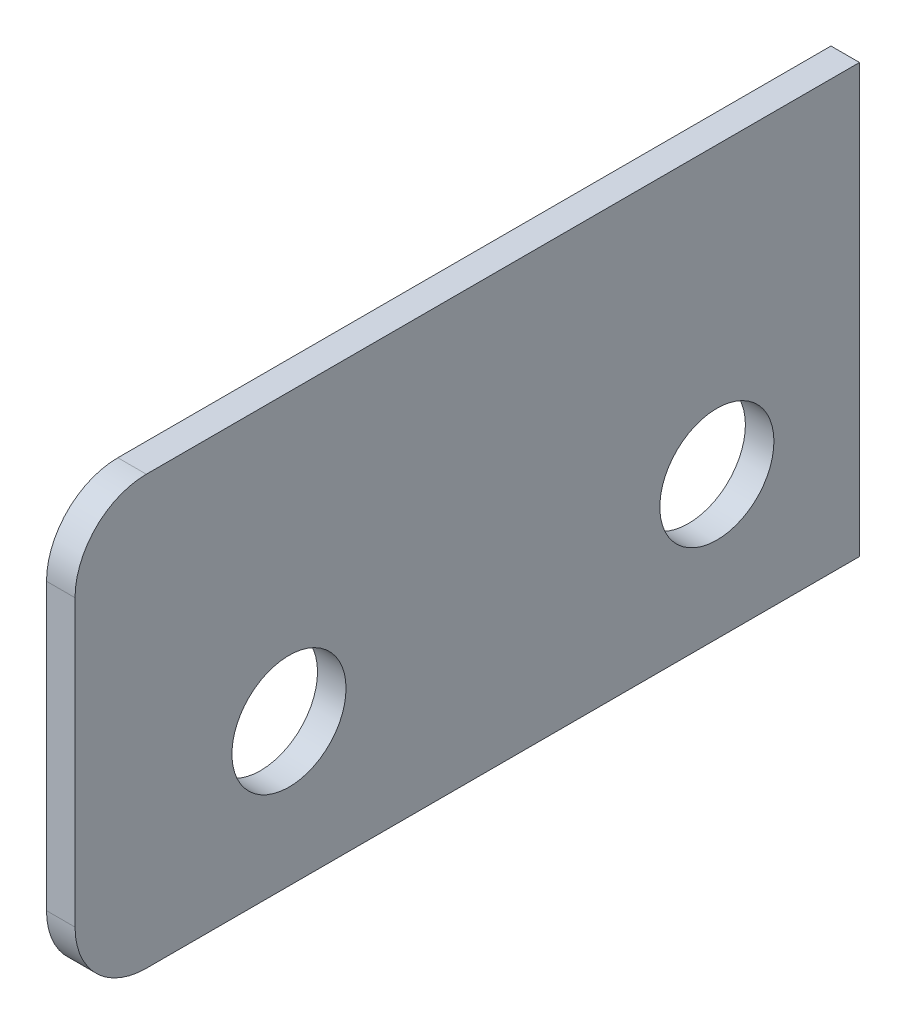
ISO-10303-21;
HEADER;
FILE_DESCRIPTION(('STEP AP214'),'2;1');
FILE_NAME('part.step','',(''),(''),'','','');
FILE_SCHEMA(('AUTOMOTIVE_DESIGN { 1 0 10303 214 1 1 1 1 }'));
ENDSEC;
DATA;
#1=APPLICATION_CONTEXT('core data for automotive mechanical design processes');
#2=APPLICATION_PROTOCOL_DEFINITION('international standard','automotive_design',2000,#1);
#3=PRODUCT_CONTEXT('',#1,'mechanical');
#4=PRODUCT('Part','Part','',(#3));
#5=PRODUCT_RELATED_PRODUCT_CATEGORY('part','',(#4));
#6=PRODUCT_DEFINITION_FORMATION('','',#4);
#7=PRODUCT_DEFINITION_CONTEXT('part definition',#1,'design');
#8=PRODUCT_DEFINITION('design','',#6,#7);
#9=PRODUCT_DEFINITION_SHAPE('','',#8);
#10=(LENGTH_UNIT() NAMED_UNIT(*) SI_UNIT(.MILLI.,.METRE.));
#11=(NAMED_UNIT(*) PLANE_ANGLE_UNIT() SI_UNIT($,.RADIAN.));
#12=(NAMED_UNIT(*) SI_UNIT($,.STERADIAN.) SOLID_ANGLE_UNIT());
#13=UNCERTAINTY_MEASURE_WITH_UNIT(LENGTH_MEASURE(1.E-05),#10,'distance_accuracy_value','');
#14=(GEOMETRIC_REPRESENTATION_CONTEXT(3) GLOBAL_UNCERTAINTY_ASSIGNED_CONTEXT((#13)) GLOBAL_UNIT_ASSIGNED_CONTEXT((#10,
#11,#12)) REPRESENTATION_CONTEXT('',''));
#15=CARTESIAN_POINT('',(0.,0.,0.));
#16=DIRECTION('',(0.,0.,1.));
#17=DIRECTION('',(1.,0.,0.));
#18=AXIS2_PLACEMENT_3D('',#15,#16,#17);
#19=CARTESIAN_POINT('',(1339.,-70.,1.99999999999999));
#20=DIRECTION('',(0.,1.,0.));
#21=DIRECTION('',(0.,0.,-1.));
#22=AXIS2_PLACEMENT_3D('',#19,#20,#21);
#23=PLANE('',#22);
#24=DIRECTION('',(0.,0.,1.));
#25=VECTOR('',#24,1.);
#26=CARTESIAN_POINT('',(1337.,-70.,1.99999999999999));
#27=LINE('',#26,#25);
#28=CARTESIAN_POINT('',(1337.,-70.,6.99999999999998));
#29=VERTEX_POINT('',#28);
#30=CARTESIAN_POINT('',(1337.,-70.,57.0000000000001));
#31=VERTEX_POINT('',#30);
#32=EDGE_CURVE('E101',#29,#31,#27,.T.);
#33=ORIENTED_EDGE('',*,*,#32,.F.);
#34=DIRECTION('',(1.,0.,0.));
#35=VECTOR('',#34,1.);
#36=CARTESIAN_POINT('',(1194.91074273878,-70.,6.99999999999998));
#37=LINE('',#36,#35);
#38=CARTESIAN_POINT('',(1339.,-70.,6.99999999999998));
#39=VERTEX_POINT('',#38);
#40=EDGE_CURVE('E50',#29,#39,#37,.T.);
#41=ORIENTED_EDGE('',*,*,#40,.T.);
#42=DIRECTION('',(0.,0.,1.));
#43=VECTOR('',#42,1.);
#44=CARTESIAN_POINT('',(1339.,-70.,1.99999999999999));
#45=LINE('',#44,#43);
#46=CARTESIAN_POINT('',(1339.,-70.,57.0000000000001));
#47=VERTEX_POINT('',#46);
#48=EDGE_CURVE('E99',#39,#47,#45,.T.);
#49=ORIENTED_EDGE('',*,*,#48,.T.);
#50=DIRECTION('',(-1.,0.,0.));
#51=VECTOR('',#50,1.);
#52=CARTESIAN_POINT('',(1339.,-70.,57.0000000000001));
#53=LINE('',#52,#51);
#54=EDGE_CURVE('E135',#31,#47,#53,.F.);
#55=ORIENTED_EDGE('',*,*,#54,.F.);
#56=EDGE_LOOP('',(#33,#41,#49,#55));
#57=FACE_BOUND('',#56,.T.);
#58=ADVANCED_FACE('F36',(#57),#23,.F.);
#59=CARTESIAN_POINT('',(1339.,-70.,62.0000000000001));
#60=DIRECTION('',(0.,0.,-1.));
#61=DIRECTION('',(-1.,0.,0.));
#62=AXIS2_PLACEMENT_3D('',#59,#60,#61);
#63=PLANE('',#62);
#64=DIRECTION('',(0.,1.,0.));
#65=VECTOR('',#64,1.);
#66=CARTESIAN_POINT('',(1339.,-70.,62.0000000000001));
#67=LINE('',#66,#65);
#68=CARTESIAN_POINT('',(1339.,-65.,62.0000000000001));
#69=VERTEX_POINT('',#68);
#70=CARTESIAN_POINT('',(1339.,-45.,62.0000000000001));
#71=VERTEX_POINT('',#70);
#72=EDGE_CURVE('E107',#69,#71,#67,.T.);
#73=ORIENTED_EDGE('',*,*,#72,.T.);
#74=DIRECTION('',(-1.,0.,0.));
#75=VECTOR('',#74,1.);
#76=CARTESIAN_POINT('',(1339.,-45.,62.0000000000001));
#77=LINE('',#76,#75);
#78=CARTESIAN_POINT('',(1337.,-45.,62.0000000000001));
#79=VERTEX_POINT('',#78);
#80=EDGE_CURVE('E121',#79,#71,#77,.F.);
#81=ORIENTED_EDGE('',*,*,#80,.F.);
#82=DIRECTION('',(0.,1.,0.));
#83=VECTOR('',#82,1.);
#84=CARTESIAN_POINT('',(1337.,-70.,62.0000000000001));
#85=LINE('',#84,#83);
#86=CARTESIAN_POINT('',(1337.,-65.,62.0000000000001));
#87=VERTEX_POINT('',#86);
#88=EDGE_CURVE('E114',#87,#79,#85,.T.);
#89=ORIENTED_EDGE('',*,*,#88,.F.);
#90=DIRECTION('',(-1.,0.,0.));
#91=VECTOR('',#90,1.);
#92=CARTESIAN_POINT('',(1339.,-65.,62.0000000000001));
#93=LINE('',#92,#91);
#94=EDGE_CURVE('E127',#69,#87,#93,.T.);
#95=ORIENTED_EDGE('',*,*,#94,.F.);
#96=EDGE_LOOP('',(#73,#81,#89,#95));
#97=FACE_BOUND('',#96,.T.);
#98=ADVANCED_FACE('F167',(#97),#63,.F.);
#99=CARTESIAN_POINT('',(1339.,-40.,2.));
#100=DIRECTION('',(0.,-1.,0.));
#101=DIRECTION('',(0.,0.,1.));
#102=AXIS2_PLACEMENT_3D('',#99,#100,#101);
#103=PLANE('',#102);
#104=DIRECTION('',(0.,0.,-1.));
#105=VECTOR('',#104,1.);
#106=CARTESIAN_POINT('',(1339.,-40.,2.));
#107=LINE('',#106,#105);
#108=CARTESIAN_POINT('',(1339.,-40.,57.0000000000001));
#109=VERTEX_POINT('',#108);
#110=CARTESIAN_POINT('',(1339.,-40.,6.99999999999999));
#111=VERTEX_POINT('',#110);
#112=EDGE_CURVE('E111',#109,#111,#107,.T.);
#113=ORIENTED_EDGE('',*,*,#112,.T.);
#114=DIRECTION('',(-1.,0.,0.));
#115=VECTOR('',#114,1.);
#116=CARTESIAN_POINT('',(1339.,-40.,6.99999999999999));
#117=LINE('',#116,#115);
#118=CARTESIAN_POINT('',(1337.,-40.,6.99999999999999));
#119=VERTEX_POINT('',#118);
#120=EDGE_CURVE('E90',#111,#119,#117,.T.);
#121=ORIENTED_EDGE('',*,*,#120,.T.);
#122=DIRECTION('',(0.,0.,-1.));
#123=VECTOR('',#122,1.);
#124=CARTESIAN_POINT('',(1337.,-40.,1.99999999999999));
#125=LINE('',#124,#123);
#126=CARTESIAN_POINT('',(1337.,-40.,57.0000000000001));
#127=VERTEX_POINT('',#126);
#128=EDGE_CURVE('E108',#127,#119,#125,.T.);
#129=ORIENTED_EDGE('',*,*,#128,.F.);
#130=DIRECTION('',(-1.,0.,0.));
#131=VECTOR('',#130,1.);
#132=CARTESIAN_POINT('',(1339.,-40.,57.0000000000001));
#133=LINE('',#132,#131);
#134=EDGE_CURVE('E44',#109,#127,#133,.T.);
#135=ORIENTED_EDGE('',*,*,#134,.F.);
#136=EDGE_LOOP('',(#113,#121,#129,#135));
#137=FACE_BOUND('',#136,.T.);
#138=ADVANCED_FACE('F161',(#137),#103,.F.);
#139=CARTESIAN_POINT('',(1339.,0.,0.));
#140=DIRECTION('',(-1.,0.,0.));
#141=DIRECTION('',(0.,0.,1.));
#142=AXIS2_PLACEMENT_3D('',#139,#140,#141);
#143=PLANE('',#142);
#144=CARTESIAN_POINT('',(1339.,-60.,47.0000000000001));
#145=DIRECTION('',(-1.,0.,0.));
#146=DIRECTION('',(0.,0.,-1.));
#147=AXIS2_PLACEMENT_3D('',#144,#145,#146);
#148=CIRCLE('',#147,4.00000000000001);
#149=CARTESIAN_POINT('',(1339.,-60.,43.));
#150=VERTEX_POINT('',#149);
#151=EDGE_CURVE('E142',#150,#150,#148,.T.);
#152=ORIENTED_EDGE('',*,*,#151,.T.);
#153=EDGE_LOOP('',(#152));
#154=FACE_BOUND('',#153,.T.);
#155=CARTESIAN_POINT('',(1339.,-60.,17.));
#156=DIRECTION('',(-1.,0.,0.));
#157=DIRECTION('',(0.,0.,-1.));
#158=AXIS2_PLACEMENT_3D('',#155,#156,#157);
#159=CIRCLE('',#158,4.);
#160=CARTESIAN_POINT('',(1339.,-60.,13.));
#161=VERTEX_POINT('',#160);
#162=EDGE_CURVE('E117',#161,#161,#159,.T.);
#163=ORIENTED_EDGE('',*,*,#162,.T.);
#164=EDGE_LOOP('',(#163));
#165=FACE_BOUND('',#164,.T.);
#166=ORIENTED_EDGE('',*,*,#48,.F.);
#167=DIRECTION('',(0.,-1.,0.));
#168=VECTOR('',#167,1.);
#169=CARTESIAN_POINT('',(1339.,70.,7.));
#170=LINE('',#169,#168);
#171=EDGE_CURVE('E87',#111,#39,#170,.T.);
#172=ORIENTED_EDGE('',*,*,#171,.F.);
#173=ORIENTED_EDGE('',*,*,#112,.F.);
#174=CARTESIAN_POINT('',(1339.,-45.,57.0000000000001));
#175=DIRECTION('',(1.,0.,0.));
#176=DIRECTION('',(0.,0.,1.));
#177=AXIS2_PLACEMENT_3D('',#174,#175,#176);
#178=CIRCLE('',#177,5.);
#179=EDGE_CURVE('E58',#71,#109,#178,.F.);
#180=ORIENTED_EDGE('',*,*,#179,.F.);
#181=ORIENTED_EDGE('',*,*,#72,.F.);
#182=CARTESIAN_POINT('',(1339.,-65.,57.0000000000001));
#183=DIRECTION('',(1.,0.,0.));
#184=DIRECTION('',(0.,0.,1.));
#185=AXIS2_PLACEMENT_3D('',#182,#183,#184);
#186=CIRCLE('',#185,5.);
#187=EDGE_CURVE('E105',#47,#69,#186,.F.);
#188=ORIENTED_EDGE('',*,*,#187,.F.);
#189=EDGE_LOOP('',(#166,#172,#173,#180,#181,#188));
#190=FACE_BOUND('',#189,.T.);
#191=ADVANCED_FACE('F103',(#154,#165,#190),#143,.F.);
#192=CARTESIAN_POINT('',(1337.,0.,0.));
#193=DIRECTION('',(-1.,0.,0.));
#194=DIRECTION('',(0.,0.,1.));
#195=AXIS2_PLACEMENT_3D('',#192,#193,#194);
#196=PLANE('',#195);
#197=DIRECTION('',(0.,1.,0.));
#198=VECTOR('',#197,1.);
#199=CARTESIAN_POINT('',(1337.,0.,6.99999999999999));
#200=LINE('',#199,#198);
#201=EDGE_CURVE('E11',#29,#119,#200,.T.);
#202=ORIENTED_EDGE('',*,*,#201,.F.);
#203=ORIENTED_EDGE('',*,*,#32,.T.);
#204=CARTESIAN_POINT('',(1337.,-65.,57.0000000000001));
#205=DIRECTION('',(1.,0.,0.));
#206=DIRECTION('',(0.,0.,1.));
#207=AXIS2_PLACEMENT_3D('',#204,#205,#206);
#208=CIRCLE('',#207,5.);
#209=EDGE_CURVE('E132',#87,#31,#208,.T.);
#210=ORIENTED_EDGE('',*,*,#209,.F.);
#211=ORIENTED_EDGE('',*,*,#88,.T.);
#212=CARTESIAN_POINT('',(1337.,-45.,57.0000000000001));
#213=DIRECTION('',(1.,0.,0.));
#214=DIRECTION('',(0.,0.,1.));
#215=AXIS2_PLACEMENT_3D('',#212,#213,#214);
#216=CIRCLE('',#215,5.);
#217=EDGE_CURVE('E130',#127,#79,#216,.T.);
#218=ORIENTED_EDGE('',*,*,#217,.F.);
#219=ORIENTED_EDGE('',*,*,#128,.T.);
#220=EDGE_LOOP('',(#202,#203,#210,#211,#218,#219));
#221=FACE_BOUND('',#220,.T.);
#222=CARTESIAN_POINT('',(1337.,-60.,47.0000000000001));
#223=DIRECTION('',(1.,0.,0.));
#224=DIRECTION('',(0.,0.,1.));
#225=AXIS2_PLACEMENT_3D('',#222,#223,#224);
#226=CIRCLE('',#225,4.00000000000001);
#227=CARTESIAN_POINT('',(1337.,-60.,51.0000000000001));
#228=VERTEX_POINT('',#227);
#229=EDGE_CURVE('E123',#228,#228,#226,.T.);
#230=ORIENTED_EDGE('',*,*,#229,.T.);
#231=EDGE_LOOP('',(#230));
#232=FACE_BOUND('',#231,.T.);
#233=CARTESIAN_POINT('',(1337.,-60.,17.));
#234=DIRECTION('',(1.,0.,0.));
#235=DIRECTION('',(0.,0.,1.));
#236=AXIS2_PLACEMENT_3D('',#233,#234,#235);
#237=CIRCLE('',#236,4.);
#238=CARTESIAN_POINT('',(1337.,-60.,21.));
#239=VERTEX_POINT('',#238);
#240=EDGE_CURVE('E140',#239,#239,#237,.T.);
#241=ORIENTED_EDGE('',*,*,#240,.T.);
#242=EDGE_LOOP('',(#241));
#243=FACE_BOUND('',#242,.T.);
#244=ADVANCED_FACE('F146',(#221,#232,#243),#196,.T.);
#245=CARTESIAN_POINT('',(1339.,-65.,57.0000000000001));
#246=DIRECTION('',(-1.,0.,0.));
#247=DIRECTION('',(0.,0.,1.));
#248=AXIS2_PLACEMENT_3D('',#245,#246,#247);
#249=CYLINDRICAL_SURFACE('',#248,5.);
#250=ORIENTED_EDGE('',*,*,#187,.T.);
#251=ORIENTED_EDGE('',*,*,#94,.T.);
#252=ORIENTED_EDGE('',*,*,#209,.T.);
#253=ORIENTED_EDGE('',*,*,#54,.T.);
#254=EDGE_LOOP('',(#250,#251,#252,#253));
#255=FACE_BOUND('',#254,.T.);
#256=ADVANCED_FACE('F169',(#255),#249,.T.);
#257=CARTESIAN_POINT('',(1339.,-45.,57.0000000000001));
#258=DIRECTION('',(-1.,0.,0.));
#259=DIRECTION('',(0.,0.,1.));
#260=AXIS2_PLACEMENT_3D('',#257,#258,#259);
#261=CYLINDRICAL_SURFACE('',#260,5.);
#262=ORIENTED_EDGE('',*,*,#179,.T.);
#263=ORIENTED_EDGE('',*,*,#134,.T.);
#264=ORIENTED_EDGE('',*,*,#217,.T.);
#265=ORIENTED_EDGE('',*,*,#80,.T.);
#266=EDGE_LOOP('',(#262,#263,#264,#265));
#267=FACE_BOUND('',#266,.T.);
#268=ADVANCED_FACE('F38',(#267),#261,.T.);
#269=CARTESIAN_POINT('',(1323.68629150101,-60.,17.));
#270=DIRECTION('',(1.,0.,0.));
#271=DIRECTION('',(0.,0.,-1.));
#272=AXIS2_PLACEMENT_3D('',#269,#270,#271);
#273=CYLINDRICAL_SURFACE('',#272,4.);
#274=ORIENTED_EDGE('',*,*,#240,.F.);
#275=EDGE_LOOP('',(#274));
#276=FACE_BOUND('',#275,.T.);
#277=ORIENTED_EDGE('',*,*,#162,.F.);
#278=EDGE_LOOP('',(#277));
#279=FACE_BOUND('',#278,.T.);
#280=ADVANCED_FACE('F152',(#276,#279),#273,.F.);
#281=CARTESIAN_POINT('',(1323.68629150101,-60.,47.0000000000001));
#282=DIRECTION('',(1.,0.,0.));
#283=DIRECTION('',(0.,0.,-1.));
#284=AXIS2_PLACEMENT_3D('',#281,#282,#283);
#285=CYLINDRICAL_SURFACE('',#284,4.00000000000001);
#286=ORIENTED_EDGE('',*,*,#229,.F.);
#287=EDGE_LOOP('',(#286));
#288=FACE_BOUND('',#287,.T.);
#289=ORIENTED_EDGE('',*,*,#151,.F.);
#290=EDGE_LOOP('',(#289));
#291=FACE_BOUND('',#290,.T.);
#292=ADVANCED_FACE('F149',(#288,#291),#285,.F.);
#293=CARTESIAN_POINT('',(1194.91074273878,70.,7.));
#294=DIRECTION('',(0.,0.,1.));
#295=DIRECTION('',(0.,-1.,0.));
#296=AXIS2_PLACEMENT_3D('',#293,#294,#295);
#297=PLANE('',#296);
#298=ORIENTED_EDGE('',*,*,#171,.T.);
#299=ORIENTED_EDGE('',*,*,#40,.F.);
#300=ORIENTED_EDGE('',*,*,#201,.T.);
#301=ORIENTED_EDGE('',*,*,#120,.F.);
#302=EDGE_LOOP('',(#298,#299,#300,#301));
#303=FACE_BOUND('',#302,.T.);
#304=ADVANCED_FACE('F88',(#303),#297,.F.);
#305=CLOSED_SHELL('',(#58,#98,#138,#191,#244,#256,#268,#280,#292,#304));
#306=MANIFOLD_SOLID_BREP('B2',#305);
#307=ADVANCED_BREP_SHAPE_REPRESENTATION('',(#18,#306),#14);
#308=SHAPE_DEFINITION_REPRESENTATION(#9,#307);
ENDSEC;
END-ISO-10303-21;
